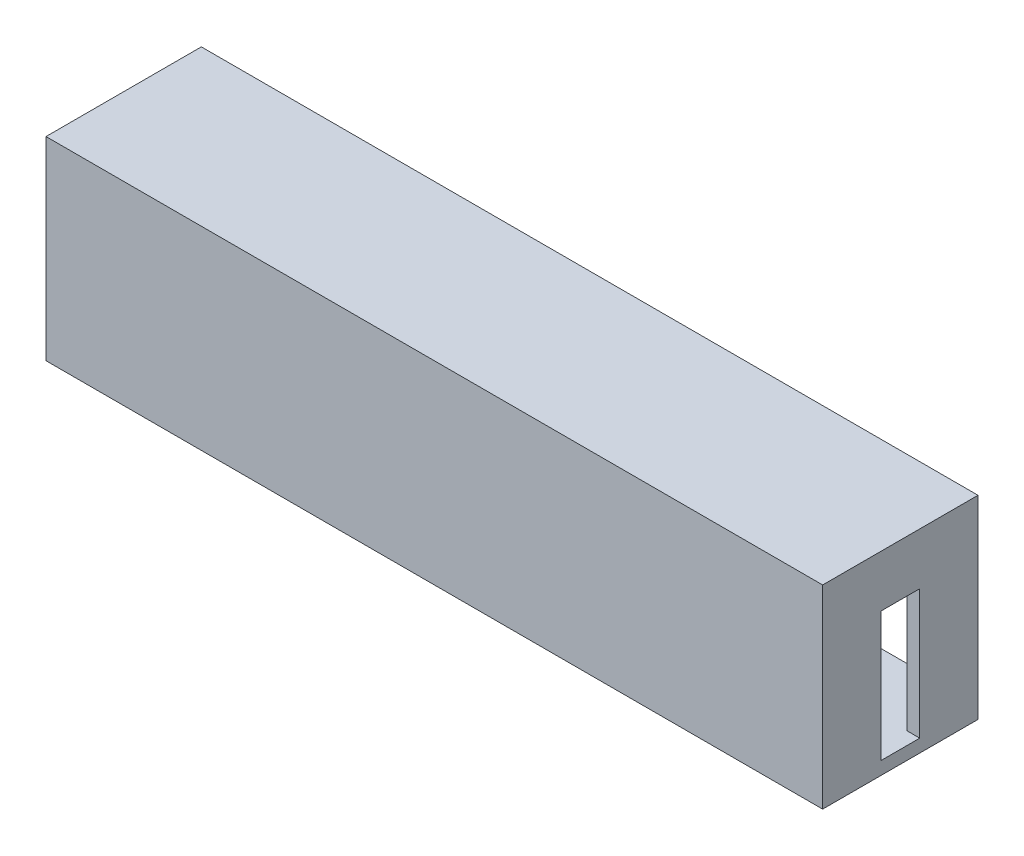
ISO-10303-21;
HEADER;
FILE_DESCRIPTION(('STEP AP214'),'2;1');
FILE_NAME('part.step','',(''),(''),'','','');
FILE_SCHEMA(('AUTOMOTIVE_DESIGN { 1 0 10303 214 1 1 1 1 }'));
ENDSEC;
DATA;
#1=APPLICATION_CONTEXT('core data for automotive mechanical design processes');
#2=APPLICATION_PROTOCOL_DEFINITION('international standard','automotive_design',2000,#1);
#3=PRODUCT_CONTEXT('',#1,'mechanical');
#4=PRODUCT('Part','Part','',(#3));
#5=PRODUCT_RELATED_PRODUCT_CATEGORY('part','',(#4));
#6=PRODUCT_DEFINITION_FORMATION('','',#4);
#7=PRODUCT_DEFINITION_CONTEXT('part definition',#1,'design');
#8=PRODUCT_DEFINITION('design','',#6,#7);
#9=PRODUCT_DEFINITION_SHAPE('','',#8);
#10=(LENGTH_UNIT() NAMED_UNIT(*) SI_UNIT(.MILLI.,.METRE.));
#11=(NAMED_UNIT(*) PLANE_ANGLE_UNIT() SI_UNIT($,.RADIAN.));
#12=(NAMED_UNIT(*) SI_UNIT($,.STERADIAN.) SOLID_ANGLE_UNIT());
#13=UNCERTAINTY_MEASURE_WITH_UNIT(LENGTH_MEASURE(1.E-05),#10,'distance_accuracy_value','');
#14=(GEOMETRIC_REPRESENTATION_CONTEXT(3) GLOBAL_UNCERTAINTY_ASSIGNED_CONTEXT((#13)) GLOBAL_UNIT_ASSIGNED_CONTEXT((#10,
#11,#12)) REPRESENTATION_CONTEXT('',''));
#15=CARTESIAN_POINT('',(0.,0.,0.));
#16=DIRECTION('',(0.,0.,1.));
#17=DIRECTION('',(1.,0.,0.));
#18=AXIS2_PLACEMENT_3D('',#15,#16,#17);
#19=CARTESIAN_POINT('',(200.,-200.,2400.));
#20=DIRECTION('',(1.,0.,0.));
#21=DIRECTION('',(0.,1.,0.));
#22=AXIS2_PLACEMENT_3D('',#19,#20,#21);
#23=PLANE('',#22);
#24=DIRECTION('',(0.,-1.,0.));
#25=VECTOR('',#24,1.);
#26=CARTESIAN_POINT('',(200.,-200.,1500.));
#27=LINE('',#26,#25);
#28=CARTESIAN_POINT('',(200.,-2180.,1500.));
#29=VERTEX_POINT('',#28);
#30=CARTESIAN_POINT('',(200.,-2800.,1500.));
#31=VERTEX_POINT('',#30);
#32=EDGE_CURVE('E302',#29,#31,#27,.T.);
#33=ORIENTED_EDGE('',*,*,#32,.F.);
#34=DIRECTION('',(0.,0.,1.));
#35=VECTOR('',#34,1.);
#36=CARTESIAN_POINT('',(200.,-2180.,1500.));
#37=LINE('',#36,#35);
#38=CARTESIAN_POINT('',(200.,-2180.,2200.));
#39=VERTEX_POINT('',#38);
#40=EDGE_CURVE('E469',#29,#39,#37,.T.);
#41=ORIENTED_EDGE('',*,*,#40,.T.);
#42=DIRECTION('',(0.,-1.,0.));
#43=VECTOR('',#42,1.);
#44=CARTESIAN_POINT('',(200.,-200.,2200.));
#45=LINE('',#44,#43);
#46=CARTESIAN_POINT('',(200.,-2800.,2200.));
#47=VERTEX_POINT('',#46);
#48=EDGE_CURVE('E486',#39,#47,#45,.T.);
#49=ORIENTED_EDGE('',*,*,#48,.T.);
#50=DIRECTION('',(0.,0.,-1.));
#51=VECTOR('',#50,1.);
#52=CARTESIAN_POINT('',(200.,-2800.,2400.));
#53=LINE('',#52,#51);
#54=EDGE_CURVE('E519',#47,#31,#53,.T.);
#55=ORIENTED_EDGE('',*,*,#54,.T.);
#56=EDGE_LOOP('',(#33,#41,#49,#55));
#57=FACE_BOUND('',#56,.T.);
#58=ADVANCED_FACE('F40',(#57),#23,.T.);
#59=CARTESIAN_POINT('',(11800.,-200.,2400.));
#60=DIRECTION('',(-1.,0.,0.));
#61=DIRECTION('',(0.,0.,1.));
#62=AXIS2_PLACEMENT_3D('',#59,#60,#61);
#63=PLANE('',#62);
#64=DIRECTION('',(0.,1.,0.));
#65=VECTOR('',#64,1.);
#66=CARTESIAN_POINT('',(11800.,-200.,1500.));
#67=LINE('',#66,#65);
#68=CARTESIAN_POINT('',(11800.,-2800.,1500.));
#69=VERTEX_POINT('',#68);
#70=CARTESIAN_POINT('',(11800.,-2180.,1500.));
#71=VERTEX_POINT('',#70);
#72=EDGE_CURVE('E297',#69,#71,#67,.T.);
#73=ORIENTED_EDGE('',*,*,#72,.F.);
#74=DIRECTION('',(0.,0.,-1.));
#75=VECTOR('',#74,1.);
#76=CARTESIAN_POINT('',(11800.,-2800.,2400.));
#77=LINE('',#76,#75);
#78=CARTESIAN_POINT('',(11800.,-2800.,2200.));
#79=VERTEX_POINT('',#78);
#80=EDGE_CURVE('E515',#79,#69,#77,.T.);
#81=ORIENTED_EDGE('',*,*,#80,.F.);
#82=DIRECTION('',(0.,1.,0.));
#83=VECTOR('',#82,1.);
#84=CARTESIAN_POINT('',(11800.,-200.,2200.));
#85=LINE('',#84,#83);
#86=CARTESIAN_POINT('',(11800.,-2180.,2200.));
#87=VERTEX_POINT('',#86);
#88=EDGE_CURVE('E477',#79,#87,#85,.T.);
#89=ORIENTED_EDGE('',*,*,#88,.T.);
#90=DIRECTION('',(0.,0.,1.));
#91=VECTOR('',#90,1.);
#92=CARTESIAN_POINT('',(11800.,-2180.,1500.));
#93=LINE('',#92,#91);
#94=EDGE_CURVE('E472',#71,#87,#93,.T.);
#95=ORIENTED_EDGE('',*,*,#94,.F.);
#96=EDGE_LOOP('',(#73,#81,#89,#95));
#97=FACE_BOUND('',#96,.T.);
#98=ADVANCED_FACE('F588',(#97),#63,.T.);
#99=CARTESIAN_POINT('',(200.,-400.000000000001,1200.));
#100=DIRECTION('',(1.,0.,0.));
#101=DIRECTION('',(0.,1.,0.));
#102=AXIS2_PLACEMENT_3D('',#99,#100,#101);
#103=CIRCLE('',#102,140.);
#104=CARTESIAN_POINT('',(200.,-260.000000000001,1200.));
#105=VERTEX_POINT('',#104);
#106=EDGE_CURVE('E573',#105,#105,#103,.T.);
#107=ORIENTED_EDGE('',*,*,#106,.F.);
#108=EDGE_LOOP('',(#107));
#109=FACE_BOUND('',#108,.T.);
#110=CARTESIAN_POINT('',(200.,-800.,1500.));
#111=VERTEX_POINT('',#110);
#112=CARTESIAN_POINT('',(200.000000000001,-2120.,1500.));
#113=VERTEX_POINT('',#112);
#114=EDGE_CURVE('E298',#111,#113,#27,.T.);
#115=ORIENTED_EDGE('',*,*,#114,.F.);
#116=DIRECTION('',(0.,0.,1.));
#117=VECTOR('',#116,1.);
#118=CARTESIAN_POINT('',(200.,-800.,2400.));
#119=LINE('',#118,#117);
#120=CARTESIAN_POINT('',(200.,-800.,900.));
#121=VERTEX_POINT('',#120);
#122=EDGE_CURVE('E325',#121,#111,#119,.T.);
#123=ORIENTED_EDGE('',*,*,#122,.F.);
#124=DIRECTION('',(0.,1.,0.));
#125=VECTOR('',#124,1.);
#126=CARTESIAN_POINT('',(200.,-200.,900.));
#127=LINE('',#126,#125);
#128=CARTESIAN_POINT('',(200.,-2800.,900.));
#129=VERTEX_POINT('',#128);
#130=EDGE_CURVE('E315',#129,#121,#127,.T.);
#131=ORIENTED_EDGE('',*,*,#130,.F.);
#132=CARTESIAN_POINT('',(200.,-2800.,0.));
#133=VERTEX_POINT('',#132);
#134=EDGE_CURVE('E518',#129,#133,#53,.T.);
#135=ORIENTED_EDGE('',*,*,#134,.T.);
#136=DIRECTION('',(0.,-1.,0.));
#137=VECTOR('',#136,1.);
#138=CARTESIAN_POINT('',(200.,-200.,0.));
#139=LINE('',#138,#137);
#140=CARTESIAN_POINT('',(200.,-200.,0.));
#141=VERTEX_POINT('',#140);
#142=EDGE_CURVE('E491',#141,#133,#139,.T.);
#143=ORIENTED_EDGE('',*,*,#142,.F.);
#144=DIRECTION('',(0.,0.,-1.));
#145=VECTOR('',#144,1.);
#146=CARTESIAN_POINT('',(200.,-200.,2400.));
#147=LINE('',#146,#145);
#148=CARTESIAN_POINT('',(200.,-200.,2200.));
#149=VERTEX_POINT('',#148);
#150=EDGE_CURVE('E508',#149,#141,#147,.T.);
#151=ORIENTED_EDGE('',*,*,#150,.F.);
#152=CARTESIAN_POINT('',(200.,-800.,2200.));
#153=VERTEX_POINT('',#152);
#154=EDGE_CURVE('E487',#149,#153,#45,.T.);
#155=ORIENTED_EDGE('',*,*,#154,.T.);
#156=DIRECTION('',(0.,0.,1.));
#157=VECTOR('',#156,1.);
#158=CARTESIAN_POINT('',(200.,-800.,1800.));
#159=LINE('',#158,#157);
#160=CARTESIAN_POINT('',(200.,-800.,1800.));
#161=VERTEX_POINT('',#160);
#162=EDGE_CURVE('E356',#161,#153,#159,.T.);
#163=ORIENTED_EDGE('',*,*,#162,.F.);
#164=DIRECTION('',(0.,1.,0.));
#165=VECTOR('',#164,1.);
#166=CARTESIAN_POINT('',(200.,-800.,1800.));
#167=LINE('',#166,#165);
#168=CARTESIAN_POINT('',(200.,-840.,1800.));
#169=VERTEX_POINT('',#168);
#170=EDGE_CURVE('E338',#169,#161,#167,.T.);
#171=ORIENTED_EDGE('',*,*,#170,.F.);
#172=DIRECTION('',(0.,0.,1.));
#173=VECTOR('',#172,1.);
#174=CARTESIAN_POINT('',(200.,-840.,1800.));
#175=LINE('',#174,#173);
#176=CARTESIAN_POINT('',(200.,-840.,2200.));
#177=VERTEX_POINT('',#176);
#178=EDGE_CURVE('E360',#169,#177,#175,.T.);
#179=ORIENTED_EDGE('',*,*,#178,.T.);
#180=CARTESIAN_POINT('',(200.,-1200.,2200.));
#181=VERTEX_POINT('',#180);
#182=EDGE_CURVE('E492',#177,#181,#45,.T.);
#183=ORIENTED_EDGE('',*,*,#182,.T.);
#184=DIRECTION('',(0.,0.,1.));
#185=VECTOR('',#184,1.);
#186=CARTESIAN_POINT('',(200.,-1200.,1800.));
#187=LINE('',#186,#185);
#188=CARTESIAN_POINT('',(200.,-1200.,1800.));
#189=VERTEX_POINT('',#188);
#190=EDGE_CURVE('E395',#189,#181,#187,.T.);
#191=ORIENTED_EDGE('',*,*,#190,.F.);
#192=DIRECTION('',(0.,1.,0.));
#193=VECTOR('',#192,1.);
#194=CARTESIAN_POINT('',(200.,-1200.,1800.));
#195=LINE('',#194,#193);
#196=CARTESIAN_POINT('',(200.,-1240.,1800.));
#197=VERTEX_POINT('',#196);
#198=EDGE_CURVE('E377',#197,#189,#195,.T.);
#199=ORIENTED_EDGE('',*,*,#198,.F.);
#200=DIRECTION('',(0.,0.,1.));
#201=VECTOR('',#200,1.);
#202=CARTESIAN_POINT('',(200.,-1240.,1800.));
#203=LINE('',#202,#201);
#204=CARTESIAN_POINT('',(200.,-1240.,2200.));
#205=VERTEX_POINT('',#204);
#206=EDGE_CURVE('E399',#197,#205,#203,.T.);
#207=ORIENTED_EDGE('',*,*,#206,.T.);
#208=CARTESIAN_POINT('',(200.,-1600.,2200.));
#209=VERTEX_POINT('',#208);
#210=EDGE_CURVE('E617',#205,#209,#45,.T.);
#211=ORIENTED_EDGE('',*,*,#210,.T.);
#212=DIRECTION('',(0.,0.,1.));
#213=VECTOR('',#212,1.);
#214=CARTESIAN_POINT('',(200.,-1600.,1800.));
#215=LINE('',#214,#213);
#216=CARTESIAN_POINT('',(200.,-1600.,1800.));
#217=VERTEX_POINT('',#216);
#218=EDGE_CURVE('E434',#217,#209,#215,.T.);
#219=ORIENTED_EDGE('',*,*,#218,.F.);
#220=DIRECTION('',(0.,1.,0.));
#221=VECTOR('',#220,1.);
#222=CARTESIAN_POINT('',(200.,-1600.,1800.));
#223=LINE('',#222,#221);
#224=CARTESIAN_POINT('',(200.,-1640.,1800.));
#225=VERTEX_POINT('',#224);
#226=EDGE_CURVE('E416',#225,#217,#223,.T.);
#227=ORIENTED_EDGE('',*,*,#226,.F.);
#228=DIRECTION('',(0.,0.,1.));
#229=VECTOR('',#228,1.);
#230=CARTESIAN_POINT('',(200.,-1640.,1800.));
#231=LINE('',#230,#229);
#232=CARTESIAN_POINT('',(200.,-1640.,2200.));
#233=VERTEX_POINT('',#232);
#234=EDGE_CURVE('E438',#225,#233,#231,.T.);
#235=ORIENTED_EDGE('',*,*,#234,.T.);
#236=CARTESIAN_POINT('',(200.,-2120.,2200.));
#237=VERTEX_POINT('',#236);
#238=EDGE_CURVE('E619',#233,#237,#45,.T.);
#239=ORIENTED_EDGE('',*,*,#238,.T.);
#240=DIRECTION('',(0.,0.,1.));
#241=VECTOR('',#240,1.);
#242=CARTESIAN_POINT('',(200.,-2120.,1500.));
#243=LINE('',#242,#241);
#244=EDGE_CURVE('E465',#113,#237,#243,.T.);
#245=ORIENTED_EDGE('',*,*,#244,.F.);
#246=EDGE_LOOP('',(#115,#123,#131,#135,#143,#151,#155,#163,#171,#179,#183,#191,#199,#207,#211,
#219,#227,#235,#239,#245));
#247=FACE_BOUND('',#246,.T.);
#248=ADVANCED_FACE('F584',(#109,#247),#23,.T.);
#249=CARTESIAN_POINT('',(11800.,-400.,1200.));
#250=DIRECTION('',(-1.,0.,0.));
#251=DIRECTION('',(0.,0.,1.));
#252=AXIS2_PLACEMENT_3D('',#249,#250,#251);
#253=CIRCLE('',#252,140.);
#254=CARTESIAN_POINT('',(11800.,-400.,1340.));
#255=VERTEX_POINT('',#254);
#256=EDGE_CURVE('E570',#255,#255,#253,.F.);
#257=ORIENTED_EDGE('',*,*,#256,.T.);
#258=EDGE_LOOP('',(#257));
#259=FACE_BOUND('',#258,.T.);
#260=CARTESIAN_POINT('',(11800.,-2120.,1500.));
#261=VERTEX_POINT('',#260);
#262=CARTESIAN_POINT('',(11800.,-800.,1500.));
#263=VERTEX_POINT('',#262);
#264=EDGE_CURVE('E293',#261,#263,#67,.T.);
#265=ORIENTED_EDGE('',*,*,#264,.F.);
#266=DIRECTION('',(0.,0.,1.));
#267=VECTOR('',#266,1.);
#268=CARTESIAN_POINT('',(11800.,-2120.,1500.));
#269=LINE('',#268,#267);
#270=CARTESIAN_POINT('',(11800.,-2120.,2200.));
#271=VERTEX_POINT('',#270);
#272=EDGE_CURVE('E455',#261,#271,#269,.T.);
#273=ORIENTED_EDGE('',*,*,#272,.T.);
#274=CARTESIAN_POINT('',(11800.,-1640.,2200.));
#275=VERTEX_POINT('',#274);
#276=EDGE_CURVE('E482',#271,#275,#85,.T.);
#277=ORIENTED_EDGE('',*,*,#276,.T.);
#278=DIRECTION('',(0.,0.,1.));
#279=VECTOR('',#278,1.);
#280=CARTESIAN_POINT('',(11800.,-1640.,1800.));
#281=LINE('',#280,#279);
#282=CARTESIAN_POINT('',(11800.,-1640.,1800.));
#283=VERTEX_POINT('',#282);
#284=EDGE_CURVE('E441',#283,#275,#281,.T.);
#285=ORIENTED_EDGE('',*,*,#284,.F.);
#286=DIRECTION('',(0.,-1.,0.));
#287=VECTOR('',#286,1.);
#288=CARTESIAN_POINT('',(11800.,-1600.,1800.));
#289=LINE('',#288,#287);
#290=CARTESIAN_POINT('',(11800.,-1600.,1800.));
#291=VERTEX_POINT('',#290);
#292=EDGE_CURVE('E407',#291,#283,#289,.T.);
#293=ORIENTED_EDGE('',*,*,#292,.F.);
#294=DIRECTION('',(0.,0.,1.));
#295=VECTOR('',#294,1.);
#296=CARTESIAN_POINT('',(11800.,-1600.,1800.));
#297=LINE('',#296,#295);
#298=CARTESIAN_POINT('',(11800.,-1600.,2200.));
#299=VERTEX_POINT('',#298);
#300=EDGE_CURVE('E424',#291,#299,#297,.T.);
#301=ORIENTED_EDGE('',*,*,#300,.T.);
#302=CARTESIAN_POINT('',(11800.,-1240.,2200.));
#303=VERTEX_POINT('',#302);
#304=EDGE_CURVE('E624',#299,#303,#85,.T.);
#305=ORIENTED_EDGE('',*,*,#304,.T.);
#306=DIRECTION('',(0.,0.,1.));
#307=VECTOR('',#306,1.);
#308=CARTESIAN_POINT('',(11800.,-1240.,1800.));
#309=LINE('',#308,#307);
#310=CARTESIAN_POINT('',(11800.,-1240.,1800.));
#311=VERTEX_POINT('',#310);
#312=EDGE_CURVE('E402',#311,#303,#309,.T.);
#313=ORIENTED_EDGE('',*,*,#312,.F.);
#314=DIRECTION('',(0.,-1.,0.));
#315=VECTOR('',#314,1.);
#316=CARTESIAN_POINT('',(11800.,-1200.,1800.));
#317=LINE('',#316,#315);
#318=CARTESIAN_POINT('',(11800.,-1200.,1800.));
#319=VERTEX_POINT('',#318);
#320=EDGE_CURVE('E368',#319,#311,#317,.T.);
#321=ORIENTED_EDGE('',*,*,#320,.F.);
#322=DIRECTION('',(0.,0.,1.));
#323=VECTOR('',#322,1.);
#324=CARTESIAN_POINT('',(11800.,-1200.,1800.));
#325=LINE('',#324,#323);
#326=CARTESIAN_POINT('',(11800.,-1200.,2200.));
#327=VERTEX_POINT('',#326);
#328=EDGE_CURVE('E385',#319,#327,#325,.T.);
#329=ORIENTED_EDGE('',*,*,#328,.T.);
#330=CARTESIAN_POINT('',(11800.,-840.,2200.));
#331=VERTEX_POINT('',#330);
#332=EDGE_CURVE('E627',#327,#331,#85,.T.);
#333=ORIENTED_EDGE('',*,*,#332,.T.);
#334=DIRECTION('',(0.,0.,1.));
#335=VECTOR('',#334,1.);
#336=CARTESIAN_POINT('',(11800.,-840.,1800.));
#337=LINE('',#336,#335);
#338=CARTESIAN_POINT('',(11800.,-840.,1800.));
#339=VERTEX_POINT('',#338);
#340=EDGE_CURVE('E363',#339,#331,#337,.T.);
#341=ORIENTED_EDGE('',*,*,#340,.F.);
#342=DIRECTION('',(0.,-1.,0.));
#343=VECTOR('',#342,1.);
#344=CARTESIAN_POINT('',(11800.,-800.,1800.));
#345=LINE('',#344,#343);
#346=CARTESIAN_POINT('',(11800.,-800.,1800.));
#347=VERTEX_POINT('',#346);
#348=EDGE_CURVE('E329',#347,#339,#345,.T.);
#349=ORIENTED_EDGE('',*,*,#348,.F.);
#350=DIRECTION('',(0.,0.,1.));
#351=VECTOR('',#350,1.);
#352=CARTESIAN_POINT('',(11800.,-800.,1800.));
#353=LINE('',#352,#351);
#354=CARTESIAN_POINT('',(11800.,-800.,2200.));
#355=VERTEX_POINT('',#354);
#356=EDGE_CURVE('E346',#347,#355,#353,.T.);
#357=ORIENTED_EDGE('',*,*,#356,.T.);
#358=CARTESIAN_POINT('',(11800.,-200.,2200.));
#359=VERTEX_POINT('',#358);
#360=EDGE_CURVE('E476',#355,#359,#85,.T.);
#361=ORIENTED_EDGE('',*,*,#360,.T.);
#362=DIRECTION('',(0.,0.,-1.));
#363=VECTOR('',#362,1.);
#364=CARTESIAN_POINT('',(11800.,-200.,2400.));
#365=LINE('',#364,#363);
#366=CARTESIAN_POINT('',(11800.,-200.,0.));
#367=VERTEX_POINT('',#366);
#368=EDGE_CURVE('E511',#359,#367,#365,.T.);
#369=ORIENTED_EDGE('',*,*,#368,.T.);
#370=DIRECTION('',(0.,1.,0.));
#371=VECTOR('',#370,1.);
#372=CARTESIAN_POINT('',(11800.,-200.,0.));
#373=LINE('',#372,#371);
#374=CARTESIAN_POINT('',(11800.,-2800.,0.));
#375=VERTEX_POINT('',#374);
#376=EDGE_CURVE('E500',#375,#367,#373,.T.);
#377=ORIENTED_EDGE('',*,*,#376,.F.);
#378=CARTESIAN_POINT('',(11800.,-2800.,900.));
#379=VERTEX_POINT('',#378);
#380=EDGE_CURVE('E514',#379,#375,#77,.T.);
#381=ORIENTED_EDGE('',*,*,#380,.F.);
#382=DIRECTION('',(0.,-1.,0.));
#383=VECTOR('',#382,1.);
#384=CARTESIAN_POINT('',(11800.,-200.,900.));
#385=LINE('',#384,#383);
#386=CARTESIAN_POINT('',(11800.,-800.,900.));
#387=VERTEX_POINT('',#386);
#388=EDGE_CURVE('E256',#387,#379,#385,.T.);
#389=ORIENTED_EDGE('',*,*,#388,.F.);
#390=DIRECTION('',(0.,0.,-1.));
#391=VECTOR('',#390,1.);
#392=CARTESIAN_POINT('',(11800.,-800.,2400.));
#393=LINE('',#392,#391);
#394=EDGE_CURVE('E322',#263,#387,#393,.T.);
#395=ORIENTED_EDGE('',*,*,#394,.F.);
#396=EDGE_LOOP('',(#265,#273,#277,#285,#293,#301,#305,#313,#321,#329,#333,#341,#349,#357,#361,
#369,#377,#381,#389,#395));
#397=FACE_BOUND('',#396,.T.);
#398=ADVANCED_FACE('F587',(#259,#397),#63,.T.);
#399=CARTESIAN_POINT('',(0.,0.,2200.));
#400=DIRECTION('',(0.,0.,1.));
#401=DIRECTION('',(1.,0.,0.));
#402=AXIS2_PLACEMENT_3D('',#399,#400,#401);
#403=PLANE('',#402);
#404=DIRECTION('',(-1.,0.,0.));
#405=VECTOR('',#404,1.);
#406=CARTESIAN_POINT('',(11800.,-840.,2200.));
#407=LINE('',#406,#405);
#408=EDGE_CURVE('E328',#331,#177,#407,.T.);
#409=ORIENTED_EDGE('',*,*,#408,.F.);
#410=ORIENTED_EDGE('',*,*,#332,.F.);
#411=DIRECTION('',(1.,0.,0.));
#412=VECTOR('',#411,1.);
#413=CARTESIAN_POINT('',(11800.,-1200.,2200.));
#414=LINE('',#413,#412);
#415=EDGE_CURVE('E373',#181,#327,#414,.T.);
#416=ORIENTED_EDGE('',*,*,#415,.F.);
#417=ORIENTED_EDGE('',*,*,#182,.F.);
#418=EDGE_LOOP('',(#409,#410,#416,#417));
#419=FACE_BOUND('',#418,.T.);
#420=ADVANCED_FACE('F648',(#419),#403,.F.);
#421=DIRECTION('',(1.,0.,0.));
#422=VECTOR('',#421,1.);
#423=CARTESIAN_POINT('',(11800.,-800.,2200.));
#424=LINE('',#423,#422);
#425=EDGE_CURVE('E334',#153,#355,#424,.T.);
#426=ORIENTED_EDGE('',*,*,#425,.F.);
#427=ORIENTED_EDGE('',*,*,#154,.F.);
#428=DIRECTION('',(-1.,0.,0.));
#429=VECTOR('',#428,1.);
#430=CARTESIAN_POINT('',(200.,-200.,2200.));
#431=LINE('',#430,#429);
#432=EDGE_CURVE('E564',#359,#149,#431,.T.);
#433=ORIENTED_EDGE('',*,*,#432,.F.);
#434=ORIENTED_EDGE('',*,*,#360,.F.);
#435=EDGE_LOOP('',(#426,#427,#433,#434));
#436=FACE_BOUND('',#435,.T.);
#437=ADVANCED_FACE('F660',(#436),#403,.F.);
#438=DIRECTION('',(-1.,0.,0.));
#439=VECTOR('',#438,1.);
#440=CARTESIAN_POINT('',(11800.,-1240.,2200.));
#441=LINE('',#440,#439);
#442=EDGE_CURVE('E367',#303,#205,#441,.T.);
#443=ORIENTED_EDGE('',*,*,#442,.F.);
#444=ORIENTED_EDGE('',*,*,#304,.F.);
#445=DIRECTION('',(1.,0.,0.));
#446=VECTOR('',#445,1.);
#447=CARTESIAN_POINT('',(11800.,-1600.,2200.));
#448=LINE('',#447,#446);
#449=EDGE_CURVE('E412',#209,#299,#448,.T.);
#450=ORIENTED_EDGE('',*,*,#449,.F.);
#451=ORIENTED_EDGE('',*,*,#210,.F.);
#452=EDGE_LOOP('',(#443,#444,#450,#451));
#453=FACE_BOUND('',#452,.T.);
#454=ADVANCED_FACE('F655',(#453),#403,.F.);
#455=DIRECTION('',(-1.,0.,0.));
#456=VECTOR('',#455,1.);
#457=CARTESIAN_POINT('',(11800.,-1640.,2200.));
#458=LINE('',#457,#456);
#459=EDGE_CURVE('E406',#275,#233,#458,.T.);
#460=ORIENTED_EDGE('',*,*,#459,.F.);
#461=ORIENTED_EDGE('',*,*,#276,.F.);
#462=DIRECTION('',(1.,0.,0.));
#463=VECTOR('',#462,1.);
#464=CARTESIAN_POINT('',(11800.,-2120.,2200.));
#465=LINE('',#464,#463);
#466=EDGE_CURVE('E451',#237,#271,#465,.T.);
#467=ORIENTED_EDGE('',*,*,#466,.F.);
#468=ORIENTED_EDGE('',*,*,#238,.F.);
#469=EDGE_LOOP('',(#460,#461,#467,#468));
#470=FACE_BOUND('',#469,.T.);
#471=ADVANCED_FACE('F646',(#470),#403,.F.);
#472=DIRECTION('',(-1.,0.,0.));
#473=VECTOR('',#472,1.);
#474=CARTESIAN_POINT('',(11800.,-2180.,2200.));
#475=LINE('',#474,#473);
#476=EDGE_CURVE('E445',#87,#39,#475,.T.);
#477=ORIENTED_EDGE('',*,*,#476,.F.);
#478=ORIENTED_EDGE('',*,*,#88,.F.);
#479=DIRECTION('',(1.,0.,0.));
#480=VECTOR('',#479,1.);
#481=CARTESIAN_POINT('',(200.,-2800.,2200.));
#482=LINE('',#481,#480);
#483=EDGE_CURVE('E481',#47,#79,#482,.T.);
#484=ORIENTED_EDGE('',*,*,#483,.F.);
#485=ORIENTED_EDGE('',*,*,#48,.F.);
#486=EDGE_LOOP('',(#477,#478,#484,#485));
#487=FACE_BOUND('',#486,.T.);
#488=ADVANCED_FACE('F644',(#487),#403,.F.);
#489=CARTESIAN_POINT('',(200.,-2800.,2400.));
#490=DIRECTION('',(0.,1.,0.));
#491=DIRECTION('',(0.,0.,1.));
#492=AXIS2_PLACEMENT_3D('',#489,#490,#491);
#493=PLANE('',#492);
#494=ORIENTED_EDGE('',*,*,#134,.F.);
#495=DIRECTION('',(1.,0.,0.));
#496=VECTOR('',#495,1.);
#497=CARTESIAN_POINT('',(-2169.,-2800.,900.));
#498=LINE('',#497,#496);
#499=CARTESIAN_POINT('',(0.,-2800.,900.));
#500=VERTEX_POINT('',#499);
#501=EDGE_CURVE('E259',#500,#129,#498,.T.);
#502=ORIENTED_EDGE('',*,*,#501,.F.);
#503=DIRECTION('',(0.,0.,-1.));
#504=VECTOR('',#503,1.);
#505=CARTESIAN_POINT('',(0.,-2800.,2400.));
#506=LINE('',#505,#504);
#507=CARTESIAN_POINT('',(0.,-2800.,1500.));
#508=VERTEX_POINT('',#507);
#509=EDGE_CURVE('E301',#508,#500,#506,.T.);
#510=ORIENTED_EDGE('',*,*,#509,.F.);
#511=DIRECTION('',(1.,0.,0.));
#512=VECTOR('',#511,1.);
#513=CARTESIAN_POINT('',(-2169.,-2800.,1500.));
#514=LINE('',#513,#512);
#515=EDGE_CURVE('E64',#508,#31,#514,.T.);
#516=ORIENTED_EDGE('',*,*,#515,.T.);
#517=ORIENTED_EDGE('',*,*,#54,.F.);
#518=ORIENTED_EDGE('',*,*,#483,.T.);
#519=ORIENTED_EDGE('',*,*,#80,.T.);
#520=CARTESIAN_POINT('',(12000.,-2800.,1500.));
#521=VERTEX_POINT('',#520);
#522=EDGE_CURVE('E267',#69,#521,#514,.T.);
#523=ORIENTED_EDGE('',*,*,#522,.T.);
#524=DIRECTION('',(0.,0.,-1.));
#525=VECTOR('',#524,1.);
#526=CARTESIAN_POINT('',(12000.,-2800.,1500.));
#527=LINE('',#526,#525);
#528=CARTESIAN_POINT('',(12000.,-2800.,900.));
#529=VERTEX_POINT('',#528);
#530=EDGE_CURVE('E263',#521,#529,#527,.T.);
#531=ORIENTED_EDGE('',*,*,#530,.T.);
#532=EDGE_CURVE('E57',#379,#529,#498,.T.);
#533=ORIENTED_EDGE('',*,*,#532,.F.);
#534=ORIENTED_EDGE('',*,*,#380,.T.);
#535=DIRECTION('',(1.,0.,0.));
#536=VECTOR('',#535,1.);
#537=CARTESIAN_POINT('',(200.,-2800.,0.));
#538=LINE('',#537,#536);
#539=EDGE_CURVE('E496',#133,#375,#538,.T.);
#540=ORIENTED_EDGE('',*,*,#539,.F.);
#541=EDGE_LOOP('',(#494,#502,#510,#516,#517,#518,#519,#523,#531,#533,#534,#540));
#542=FACE_BOUND('',#541,.T.);
#543=ADVANCED_FACE('F265',(#542),#493,.T.);
#544=CARTESIAN_POINT('',(200.,-200.,2400.));
#545=DIRECTION('',(0.,-1.,0.));
#546=DIRECTION('',(0.,0.,-1.));
#547=AXIS2_PLACEMENT_3D('',#544,#545,#546);
#548=PLANE('',#547);
#549=ORIENTED_EDGE('',*,*,#368,.F.);
#550=ORIENTED_EDGE('',*,*,#432,.T.);
#551=ORIENTED_EDGE('',*,*,#150,.T.);
#552=DIRECTION('',(-1.,0.,0.));
#553=VECTOR('',#552,1.);
#554=CARTESIAN_POINT('',(200.,-200.,0.));
#555=LINE('',#554,#553);
#556=EDGE_CURVE('E504',#367,#141,#555,.T.);
#557=ORIENTED_EDGE('',*,*,#556,.F.);
#558=EDGE_LOOP('',(#549,#550,#551,#557));
#559=FACE_BOUND('',#558,.T.);
#560=ADVANCED_FACE('F653',(#559),#548,.T.);
#561=CARTESIAN_POINT('',(0.,0.,2400.));
#562=DIRECTION('',(0.,0.,1.));
#563=DIRECTION('',(1.,0.,0.));
#564=AXIS2_PLACEMENT_3D('',#561,#562,#563);
#565=PLANE('',#564);
#566=DIRECTION('',(0.,-1.,0.));
#567=VECTOR('',#566,1.);
#568=CARTESIAN_POINT('',(0.,0.,2400.));
#569=LINE('',#568,#567);
#570=CARTESIAN_POINT('',(0.,0.,2400.));
#571=VERTEX_POINT('',#570);
#572=CARTESIAN_POINT('',(0.,-3000.,2400.));
#573=VERTEX_POINT('',#572);
#574=EDGE_CURVE('E524',#571,#573,#569,.T.);
#575=ORIENTED_EDGE('',*,*,#574,.T.);
#576=DIRECTION('',(1.,0.,0.));
#577=VECTOR('',#576,1.);
#578=CARTESIAN_POINT('',(0.,-3000.,2400.));
#579=LINE('',#578,#577);
#580=CARTESIAN_POINT('',(12000.,-3000.,2400.));
#581=VERTEX_POINT('',#580);
#582=EDGE_CURVE('E528',#573,#581,#579,.T.);
#583=ORIENTED_EDGE('',*,*,#582,.T.);
#584=DIRECTION('',(0.,1.,0.));
#585=VECTOR('',#584,1.);
#586=CARTESIAN_POINT('',(12000.,0.,2400.));
#587=LINE('',#586,#585);
#588=CARTESIAN_POINT('',(12000.,0.,2400.));
#589=VERTEX_POINT('',#588);
#590=EDGE_CURVE('E532',#581,#589,#587,.T.);
#591=ORIENTED_EDGE('',*,*,#590,.T.);
#592=DIRECTION('',(-1.,0.,0.));
#593=VECTOR('',#592,1.);
#594=CARTESIAN_POINT('',(0.,0.,2400.));
#595=LINE('',#594,#593);
#596=EDGE_CURVE('E535',#589,#571,#595,.T.);
#597=ORIENTED_EDGE('',*,*,#596,.T.);
#598=EDGE_LOOP('',(#575,#583,#591,#597));
#599=FACE_BOUND('',#598,.T.);
#600=ADVANCED_FACE('F770',(#599),#565,.T.);
#601=CARTESIAN_POINT('',(0.,0.,0.));
#602=DIRECTION('',(0.,0.,1.));
#603=DIRECTION('',(1.,0.,0.));
#604=AXIS2_PLACEMENT_3D('',#601,#602,#603);
#605=PLANE('',#604);
#606=DIRECTION('',(0.,-1.,0.));
#607=VECTOR('',#606,1.);
#608=CARTESIAN_POINT('',(0.,0.,0.));
#609=LINE('',#608,#607);
#610=CARTESIAN_POINT('',(0.,0.,0.));
#611=VERTEX_POINT('',#610);
#612=CARTESIAN_POINT('',(0.,-3000.,0.));
#613=VERTEX_POINT('',#612);
#614=EDGE_CURVE('E523',#611,#613,#609,.T.);
#615=ORIENTED_EDGE('',*,*,#614,.F.);
#616=DIRECTION('',(-1.,0.,0.));
#617=VECTOR('',#616,1.);
#618=CARTESIAN_POINT('',(0.,0.,0.));
#619=LINE('',#618,#617);
#620=CARTESIAN_POINT('',(12000.,0.,0.));
#621=VERTEX_POINT('',#620);
#622=EDGE_CURVE('E529',#621,#611,#619,.T.);
#623=ORIENTED_EDGE('',*,*,#622,.F.);
#624=DIRECTION('',(0.,1.,0.));
#625=VECTOR('',#624,1.);
#626=CARTESIAN_POINT('',(12000.,0.,0.));
#627=LINE('',#626,#625);
#628=CARTESIAN_POINT('',(12000.,-3000.,0.));
#629=VERTEX_POINT('',#628);
#630=EDGE_CURVE('E546',#629,#621,#627,.T.);
#631=ORIENTED_EDGE('',*,*,#630,.F.);
#632=DIRECTION('',(1.,0.,0.));
#633=VECTOR('',#632,1.);
#634=CARTESIAN_POINT('',(0.,-3000.,0.));
#635=LINE('',#634,#633);
#636=EDGE_CURVE('E542',#613,#629,#635,.T.);
#637=ORIENTED_EDGE('',*,*,#636,.F.);
#638=EDGE_LOOP('',(#615,#623,#631,#637));
#639=FACE_BOUND('',#638,.T.);
#640=ORIENTED_EDGE('',*,*,#142,.T.);
#641=ORIENTED_EDGE('',*,*,#539,.T.);
#642=ORIENTED_EDGE('',*,*,#376,.T.);
#643=ORIENTED_EDGE('',*,*,#556,.T.);
#644=EDGE_LOOP('',(#640,#641,#642,#643));
#645=FACE_BOUND('',#644,.T.);
#646=ADVANCED_FACE('F748',(#639,#645),#605,.F.);
#647=CARTESIAN_POINT('',(0.,0.,2400.));
#648=DIRECTION('',(1.,0.,0.));
#649=DIRECTION('',(0.,0.,-1.));
#650=AXIS2_PLACEMENT_3D('',#647,#648,#649);
#651=PLANE('',#650);
#652=DIRECTION('',(0.,0.,1.));
#653=VECTOR('',#652,1.);
#654=CARTESIAN_POINT('',(0.,-800.,2400.));
#655=LINE('',#654,#653);
#656=CARTESIAN_POINT('',(0.,-800.,900.));
#657=VERTEX_POINT('',#656);
#658=CARTESIAN_POINT('',(0.,-800.,1500.));
#659=VERTEX_POINT('',#658);
#660=EDGE_CURVE('E318',#657,#659,#655,.T.);
#661=ORIENTED_EDGE('',*,*,#660,.T.);
#662=DIRECTION('',(0.,-1.,0.));
#663=VECTOR('',#662,1.);
#664=CARTESIAN_POINT('',(0.,0.,1500.));
#665=LINE('',#664,#663);
#666=EDGE_CURVE('E296',#659,#508,#665,.T.);
#667=ORIENTED_EDGE('',*,*,#666,.T.);
#668=ORIENTED_EDGE('',*,*,#509,.T.);
#669=DIRECTION('',(0.,1.,0.));
#670=VECTOR('',#669,1.);
#671=CARTESIAN_POINT('',(0.,0.,900.));
#672=LINE('',#671,#670);
#673=EDGE_CURVE('E309',#500,#657,#672,.T.);
#674=ORIENTED_EDGE('',*,*,#673,.T.);
#675=EDGE_LOOP('',(#661,#667,#668,#674));
#676=FACE_BOUND('',#675,.T.);
#677=DIRECTION('',(0.,0.,-1.));
#678=VECTOR('',#677,1.);
#679=CARTESIAN_POINT('',(0.,0.,2400.));
#680=LINE('',#679,#678);
#681=EDGE_CURVE('E538',#571,#611,#680,.T.);
#682=ORIENTED_EDGE('',*,*,#681,.T.);
#683=ORIENTED_EDGE('',*,*,#614,.T.);
#684=DIRECTION('',(0.,0.,-1.));
#685=VECTOR('',#684,1.);
#686=CARTESIAN_POINT('',(0.,-3000.,2400.));
#687=LINE('',#686,#685);
#688=EDGE_CURVE('E561',#573,#613,#687,.T.);
#689=ORIENTED_EDGE('',*,*,#688,.F.);
#690=ORIENTED_EDGE('',*,*,#574,.F.);
#691=EDGE_LOOP('',(#682,#683,#689,#690));
#692=FACE_BOUND('',#691,.T.);
#693=ADVANCED_FACE('F42',(#676,#692),#651,.F.);
#694=CARTESIAN_POINT('',(0.,-3000.,2400.));
#695=DIRECTION('',(0.,1.,0.));
#696=DIRECTION('',(0.,0.,1.));
#697=AXIS2_PLACEMENT_3D('',#694,#695,#696);
#698=PLANE('',#697);
#699=ORIENTED_EDGE('',*,*,#688,.T.);
#700=ORIENTED_EDGE('',*,*,#636,.T.);
#701=DIRECTION('',(0.,0.,-1.));
#702=VECTOR('',#701,1.);
#703=CARTESIAN_POINT('',(12000.,-3000.,2400.));
#704=LINE('',#703,#702);
#705=EDGE_CURVE('E558',#581,#629,#704,.T.);
#706=ORIENTED_EDGE('',*,*,#705,.F.);
#707=ORIENTED_EDGE('',*,*,#582,.F.);
#708=EDGE_LOOP('',(#699,#700,#706,#707));
#709=FACE_BOUND('',#708,.T.);
#710=ADVANCED_FACE('F745',(#709),#698,.F.);
#711=CARTESIAN_POINT('',(12000.,0.,2400.));
#712=DIRECTION('',(-1.,0.,0.));
#713=DIRECTION('',(0.,0.,1.));
#714=AXIS2_PLACEMENT_3D('',#711,#712,#713);
#715=PLANE('',#714);
#716=ORIENTED_EDGE('',*,*,#530,.F.);
#717=DIRECTION('',(0.,-1.,0.));
#718=VECTOR('',#717,1.);
#719=CARTESIAN_POINT('',(12000.,-2800.,1500.));
#720=LINE('',#719,#718);
#721=CARTESIAN_POINT('',(12000.,-800.,1500.));
#722=VERTEX_POINT('',#721);
#723=EDGE_CURVE('E271',#722,#521,#720,.T.);
#724=ORIENTED_EDGE('',*,*,#723,.F.);
#725=DIRECTION('',(0.,0.,1.));
#726=VECTOR('',#725,1.);
#727=CARTESIAN_POINT('',(12000.,-800.,1500.));
#728=LINE('',#727,#726);
#729=CARTESIAN_POINT('',(12000.,-800.,900.));
#730=VERTEX_POINT('',#729);
#731=EDGE_CURVE('E276',#730,#722,#728,.T.);
#732=ORIENTED_EDGE('',*,*,#731,.F.);
#733=DIRECTION('',(0.,1.,0.));
#734=VECTOR('',#733,1.);
#735=CARTESIAN_POINT('',(12000.,-2800.,900.));
#736=LINE('',#735,#734);
#737=EDGE_CURVE('E253',#529,#730,#736,.T.);
#738=ORIENTED_EDGE('',*,*,#737,.F.);
#739=EDGE_LOOP('',(#716,#724,#732,#738));
#740=FACE_BOUND('',#739,.T.);
#741=ORIENTED_EDGE('',*,*,#705,.T.);
#742=ORIENTED_EDGE('',*,*,#630,.T.);
#743=DIRECTION('',(0.,0.,-1.));
#744=VECTOR('',#743,1.);
#745=CARTESIAN_POINT('',(12000.,0.,2400.));
#746=LINE('',#745,#744);
#747=EDGE_CURVE('E555',#589,#621,#746,.T.);
#748=ORIENTED_EDGE('',*,*,#747,.F.);
#749=ORIENTED_EDGE('',*,*,#590,.F.);
#750=EDGE_LOOP('',(#741,#742,#748,#749));
#751=FACE_BOUND('',#750,.T.);
#752=ADVANCED_FACE('F273',(#740,#751),#715,.F.);
#753=CARTESIAN_POINT('',(0.,0.,2400.));
#754=DIRECTION('',(0.,-1.,0.));
#755=DIRECTION('',(0.,0.,-1.));
#756=AXIS2_PLACEMENT_3D('',#753,#754,#755);
#757=PLANE('',#756);
#758=ORIENTED_EDGE('',*,*,#747,.T.);
#759=ORIENTED_EDGE('',*,*,#622,.T.);
#760=ORIENTED_EDGE('',*,*,#681,.F.);
#761=ORIENTED_EDGE('',*,*,#596,.F.);
#762=EDGE_LOOP('',(#758,#759,#760,#761));
#763=FACE_BOUND('',#762,.T.);
#764=ADVANCED_FACE('F736',(#763),#757,.F.);
#765=CARTESIAN_POINT('',(11800.,-2180.,1500.));
#766=DIRECTION('',(0.,1.,0.));
#767=DIRECTION('',(0.,0.,1.));
#768=AXIS2_PLACEMENT_3D('',#765,#766,#767);
#769=PLANE('',#768);
#770=ORIENTED_EDGE('',*,*,#476,.T.);
#771=ORIENTED_EDGE('',*,*,#40,.F.);
#772=DIRECTION('',(-1.,0.,0.));
#773=VECTOR('',#772,1.);
#774=CARTESIAN_POINT('',(11800.,-2180.,1500.));
#775=LINE('',#774,#773);
#776=EDGE_CURVE('E446',#71,#29,#775,.T.);
#777=ORIENTED_EDGE('',*,*,#776,.F.);
#778=ORIENTED_EDGE('',*,*,#94,.T.);
#779=EDGE_LOOP('',(#770,#771,#777,#778));
#780=FACE_BOUND('',#779,.T.);
#781=ADVANCED_FACE('F639',(#780),#769,.F.);
#782=CARTESIAN_POINT('',(11800.,-2120.,1500.));
#783=DIRECTION('',(0.,-1.,0.));
#784=DIRECTION('',(0.,0.,-1.));
#785=AXIS2_PLACEMENT_3D('',#782,#783,#784);
#786=PLANE('',#785);
#787=ORIENTED_EDGE('',*,*,#466,.T.);
#788=ORIENTED_EDGE('',*,*,#272,.F.);
#789=DIRECTION('',(1.,0.,0.));
#790=VECTOR('',#789,1.);
#791=CARTESIAN_POINT('',(11800.,-2120.,1500.));
#792=LINE('',#791,#790);
#793=EDGE_CURVE('E450',#113,#261,#792,.T.);
#794=ORIENTED_EDGE('',*,*,#793,.F.);
#795=ORIENTED_EDGE('',*,*,#244,.T.);
#796=EDGE_LOOP('',(#787,#788,#794,#795));
#797=FACE_BOUND('',#796,.T.);
#798=ADVANCED_FACE('F732',(#797),#786,.F.);
#799=CARTESIAN_POINT('',(0.,0.,1500.));
#800=DIRECTION('',(0.,0.,-1.));
#801=DIRECTION('',(-1.,0.,0.));
#802=AXIS2_PLACEMENT_3D('',#799,#800,#801);
#803=PLANE('',#802);
#804=ORIENTED_EDGE('',*,*,#793,.T.);
#805=ORIENTED_EDGE('',*,*,#264,.T.);
#806=DIRECTION('',(1.,0.,0.));
#807=VECTOR('',#806,1.);
#808=CARTESIAN_POINT('',(-2169.,-800.,1500.));
#809=LINE('',#808,#807);
#810=EDGE_CURVE('E283',#263,#722,#809,.T.);
#811=ORIENTED_EDGE('',*,*,#810,.T.);
#812=ORIENTED_EDGE('',*,*,#723,.T.);
#813=ORIENTED_EDGE('',*,*,#522,.F.);
#814=ORIENTED_EDGE('',*,*,#72,.T.);
#815=ORIENTED_EDGE('',*,*,#776,.T.);
#816=ORIENTED_EDGE('',*,*,#32,.T.);
#817=ORIENTED_EDGE('',*,*,#515,.F.);
#818=ORIENTED_EDGE('',*,*,#666,.F.);
#819=EDGE_CURVE('E286',#659,#111,#809,.T.);
#820=ORIENTED_EDGE('',*,*,#819,.T.);
#821=ORIENTED_EDGE('',*,*,#114,.T.);
#822=EDGE_LOOP('',(#804,#805,#811,#812,#813,#814,#815,#816,#817,#818,#820,#821));
#823=FACE_BOUND('',#822,.T.);
#824=ADVANCED_FACE('F598',(#823),#803,.T.);
#825=CARTESIAN_POINT('',(11800.,-1640.,1800.));
#826=DIRECTION('',(0.,1.,0.));
#827=DIRECTION('',(-1.,0.,0.));
#828=AXIS2_PLACEMENT_3D('',#825,#826,#827);
#829=PLANE('',#828);
#830=ORIENTED_EDGE('',*,*,#459,.T.);
#831=ORIENTED_EDGE('',*,*,#234,.F.);
#832=DIRECTION('',(-1.,0.,0.));
#833=VECTOR('',#832,1.);
#834=CARTESIAN_POINT('',(11800.,-1640.,1800.));
#835=LINE('',#834,#833);
#836=EDGE_CURVE('E411',#283,#225,#835,.T.);
#837=ORIENTED_EDGE('',*,*,#836,.F.);
#838=ORIENTED_EDGE('',*,*,#284,.T.);
#839=EDGE_LOOP('',(#830,#831,#837,#838));
#840=FACE_BOUND('',#839,.T.);
#841=ADVANCED_FACE('F725',(#840),#829,.F.);
#842=CARTESIAN_POINT('',(11800.,-1600.,1800.));
#843=DIRECTION('',(0.,-1.,0.));
#844=DIRECTION('',(0.,0.,-1.));
#845=AXIS2_PLACEMENT_3D('',#842,#843,#844);
#846=PLANE('',#845);
#847=ORIENTED_EDGE('',*,*,#449,.T.);
#848=ORIENTED_EDGE('',*,*,#300,.F.);
#849=DIRECTION('',(1.,0.,0.));
#850=VECTOR('',#849,1.);
#851=CARTESIAN_POINT('',(11800.,-1600.,1800.));
#852=LINE('',#851,#850);
#853=EDGE_CURVE('E420',#217,#291,#852,.T.);
#854=ORIENTED_EDGE('',*,*,#853,.F.);
#855=ORIENTED_EDGE('',*,*,#218,.T.);
#856=EDGE_LOOP('',(#847,#848,#854,#855));
#857=FACE_BOUND('',#856,.T.);
#858=ADVANCED_FACE('F721',(#857),#846,.F.);
#859=CARTESIAN_POINT('',(0.,0.,1800.));
#860=DIRECTION('',(0.,0.,-1.));
#861=DIRECTION('',(-1.,0.,0.));
#862=AXIS2_PLACEMENT_3D('',#859,#860,#861);
#863=PLANE('',#862);
#864=ORIENTED_EDGE('',*,*,#292,.T.);
#865=ORIENTED_EDGE('',*,*,#836,.T.);
#866=ORIENTED_EDGE('',*,*,#226,.T.);
#867=ORIENTED_EDGE('',*,*,#853,.T.);
#868=EDGE_LOOP('',(#864,#865,#866,#867));
#869=FACE_BOUND('',#868,.T.);
#870=ADVANCED_FACE('F717',(#869),#863,.T.);
#871=CARTESIAN_POINT('',(11800.,-1240.,1800.));
#872=DIRECTION('',(0.,1.,0.));
#873=DIRECTION('',(0.,0.,1.));
#874=AXIS2_PLACEMENT_3D('',#871,#872,#873);
#875=PLANE('',#874);
#876=ORIENTED_EDGE('',*,*,#442,.T.);
#877=ORIENTED_EDGE('',*,*,#206,.F.);
#878=DIRECTION('',(-1.,0.,0.));
#879=VECTOR('',#878,1.);
#880=CARTESIAN_POINT('',(11800.,-1240.,1800.));
#881=LINE('',#880,#879);
#882=EDGE_CURVE('E372',#311,#197,#881,.T.);
#883=ORIENTED_EDGE('',*,*,#882,.F.);
#884=ORIENTED_EDGE('',*,*,#312,.T.);
#885=EDGE_LOOP('',(#876,#877,#883,#884));
#886=FACE_BOUND('',#885,.T.);
#887=ADVANCED_FACE('F713',(#886),#875,.F.);
#888=CARTESIAN_POINT('',(11800.,-1200.,1800.));
#889=DIRECTION('',(0.,-1.,0.));
#890=DIRECTION('',(0.,0.,-1.));
#891=AXIS2_PLACEMENT_3D('',#888,#889,#890);
#892=PLANE('',#891);
#893=ORIENTED_EDGE('',*,*,#415,.T.);
#894=ORIENTED_EDGE('',*,*,#328,.F.);
#895=DIRECTION('',(1.,0.,0.));
#896=VECTOR('',#895,1.);
#897=CARTESIAN_POINT('',(11800.,-1200.,1800.));
#898=LINE('',#897,#896);
#899=EDGE_CURVE('E381',#189,#319,#898,.T.);
#900=ORIENTED_EDGE('',*,*,#899,.F.);
#901=ORIENTED_EDGE('',*,*,#190,.T.);
#902=EDGE_LOOP('',(#893,#894,#900,#901));
#903=FACE_BOUND('',#902,.T.);
#904=ADVANCED_FACE('F709',(#903),#892,.F.);
#905=CARTESIAN_POINT('',(0.,0.,1800.));
#906=DIRECTION('',(0.,0.,-1.));
#907=DIRECTION('',(-1.,0.,0.));
#908=AXIS2_PLACEMENT_3D('',#905,#906,#907);
#909=PLANE('',#908);
#910=ORIENTED_EDGE('',*,*,#320,.T.);
#911=ORIENTED_EDGE('',*,*,#882,.T.);
#912=ORIENTED_EDGE('',*,*,#198,.T.);
#913=ORIENTED_EDGE('',*,*,#899,.T.);
#914=EDGE_LOOP('',(#910,#911,#912,#913));
#915=FACE_BOUND('',#914,.T.);
#916=ADVANCED_FACE('F705',(#915),#909,.T.);
#917=CARTESIAN_POINT('',(11800.,-840.,1800.));
#918=DIRECTION('',(0.,1.,0.));
#919=DIRECTION('',(0.,0.,1.));
#920=AXIS2_PLACEMENT_3D('',#917,#918,#919);
#921=PLANE('',#920);
#922=ORIENTED_EDGE('',*,*,#408,.T.);
#923=ORIENTED_EDGE('',*,*,#178,.F.);
#924=DIRECTION('',(-1.,0.,0.));
#925=VECTOR('',#924,1.);
#926=CARTESIAN_POINT('',(11800.,-840.,1800.));
#927=LINE('',#926,#925);
#928=EDGE_CURVE('E333',#339,#169,#927,.T.);
#929=ORIENTED_EDGE('',*,*,#928,.F.);
#930=ORIENTED_EDGE('',*,*,#340,.T.);
#931=EDGE_LOOP('',(#922,#923,#929,#930));
#932=FACE_BOUND('',#931,.T.);
#933=ADVANCED_FACE('F701',(#932),#921,.F.);
#934=CARTESIAN_POINT('',(11800.,-800.,1800.));
#935=DIRECTION('',(0.,-1.,0.));
#936=DIRECTION('',(0.,0.,-1.));
#937=AXIS2_PLACEMENT_3D('',#934,#935,#936);
#938=PLANE('',#937);
#939=ORIENTED_EDGE('',*,*,#425,.T.);
#940=ORIENTED_EDGE('',*,*,#356,.F.);
#941=DIRECTION('',(1.,0.,0.));
#942=VECTOR('',#941,1.);
#943=CARTESIAN_POINT('',(11800.,-800.,1800.));
#944=LINE('',#943,#942);
#945=EDGE_CURVE('E342',#161,#347,#944,.T.);
#946=ORIENTED_EDGE('',*,*,#945,.F.);
#947=ORIENTED_EDGE('',*,*,#162,.T.);
#948=EDGE_LOOP('',(#939,#940,#946,#947));
#949=FACE_BOUND('',#948,.T.);
#950=ADVANCED_FACE('F697',(#949),#938,.F.);
#951=CARTESIAN_POINT('',(0.,0.,1800.));
#952=DIRECTION('',(0.,0.,-1.));
#953=DIRECTION('',(-1.,0.,0.));
#954=AXIS2_PLACEMENT_3D('',#951,#952,#953);
#955=PLANE('',#954);
#956=ORIENTED_EDGE('',*,*,#348,.T.);
#957=ORIENTED_EDGE('',*,*,#928,.T.);
#958=ORIENTED_EDGE('',*,*,#170,.T.);
#959=ORIENTED_EDGE('',*,*,#945,.T.);
#960=EDGE_LOOP('',(#956,#957,#958,#959));
#961=FACE_BOUND('',#960,.T.);
#962=ADVANCED_FACE('F694',(#961),#955,.T.);
#963=CARTESIAN_POINT('',(-2169.,-2800.,900.));
#964=DIRECTION('',(0.,0.,-1.));
#965=DIRECTION('',(-1.,0.,0.));
#966=AXIS2_PLACEMENT_3D('',#963,#964,#965);
#967=PLANE('',#966);
#968=ORIENTED_EDGE('',*,*,#388,.T.);
#969=ORIENTED_EDGE('',*,*,#532,.T.);
#970=ORIENTED_EDGE('',*,*,#737,.T.);
#971=DIRECTION('',(1.,0.,0.));
#972=VECTOR('',#971,1.);
#973=CARTESIAN_POINT('',(-2169.,-800.,900.));
#974=LINE('',#973,#972);
#975=EDGE_CURVE('E288',#387,#730,#974,.T.);
#976=ORIENTED_EDGE('',*,*,#975,.F.);
#977=EDGE_LOOP('',(#968,#969,#970,#976));
#978=FACE_BOUND('',#977,.T.);
#979=ADVANCED_FACE('F250',(#978),#967,.F.);
#980=CARTESIAN_POINT('',(-2169.,-800.,1500.));
#981=DIRECTION('',(0.,1.,0.));
#982=DIRECTION('',(0.,0.,1.));
#983=AXIS2_PLACEMENT_3D('',#980,#981,#982);
#984=PLANE('',#983);
#985=ORIENTED_EDGE('',*,*,#394,.T.);
#986=ORIENTED_EDGE('',*,*,#975,.T.);
#987=ORIENTED_EDGE('',*,*,#731,.T.);
#988=ORIENTED_EDGE('',*,*,#810,.F.);
#989=EDGE_LOOP('',(#985,#986,#987,#988));
#990=FACE_BOUND('',#989,.T.);
#991=ADVANCED_FACE('F691',(#990),#984,.F.);
#992=ORIENTED_EDGE('',*,*,#122,.T.);
#993=ORIENTED_EDGE('',*,*,#819,.F.);
#994=ORIENTED_EDGE('',*,*,#660,.F.);
#995=EDGE_CURVE('E287',#657,#121,#974,.T.);
#996=ORIENTED_EDGE('',*,*,#995,.T.);
#997=EDGE_LOOP('',(#992,#993,#994,#996));
#998=FACE_BOUND('',#997,.T.);
#999=ADVANCED_FACE('F688',(#998),#984,.F.);
#1000=ORIENTED_EDGE('',*,*,#130,.T.);
#1001=ORIENTED_EDGE('',*,*,#995,.F.);
#1002=ORIENTED_EDGE('',*,*,#673,.F.);
#1003=ORIENTED_EDGE('',*,*,#501,.T.);
#1004=EDGE_LOOP('',(#1000,#1001,#1002,#1003));
#1005=FACE_BOUND('',#1004,.T.);
#1006=ADVANCED_FACE('F609',(#1005),#967,.F.);
#1007=CARTESIAN_POINT('',(11862.,-400.,1200.));
#1008=DIRECTION('',(-1.,0.,0.));
#1009=DIRECTION('',(0.,-1.,0.));
#1010=AXIS2_PLACEMENT_3D('',#1007,#1008,#1009);
#1011=CYLINDRICAL_SURFACE('',#1010,140.);
#1012=ORIENTED_EDGE('',*,*,#256,.F.);
#1013=EDGE_LOOP('',(#1012));
#1014=FACE_BOUND('',#1013,.T.);
#1015=ORIENTED_EDGE('',*,*,#106,.T.);
#1016=EDGE_LOOP('',(#1015));
#1017=FACE_BOUND('',#1016,.T.);
#1018=ADVANCED_FACE('F582',(#1014,#1017),#1011,.T.);
#1019=CLOSED_SHELL('',(#58,#98,#248,#398,#420,#437,#454,#471,#488,#543,#560,#600,#646,#693,#710,
#752,#764,#781,#798,#824,#841,#858,#870,#887,#904,#916,#933,#950,#962,#979,#991,#999,#1006,#1018));
#1020=CARTESIAN_POINT('',(11862.,-400.,1200.));
#1021=DIRECTION('',(-1.,0.,0.));
#1022=DIRECTION('',(0.,-1.,0.));
#1023=AXIS2_PLACEMENT_3D('',#1020,#1021,#1022);
#1024=CYLINDRICAL_SURFACE('',#1023,90.0000000000002);
#1025=CARTESIAN_POINT('',(11800.,-400.,1200.));
#1026=DIRECTION('',(-1.,0.,0.));
#1027=DIRECTION('',(0.,0.,1.));
#1028=AXIS2_PLACEMENT_3D('',#1025,#1026,#1027);
#1029=CIRCLE('',#1028,90.0000000000002);
#1030=CARTESIAN_POINT('',(11800.,-400.,1290.));
#1031=VERTEX_POINT('',#1030);
#1032=EDGE_CURVE('E50',#1031,#1031,#1029,.F.);
#1033=ORIENTED_EDGE('',*,*,#1032,.T.);
#1034=EDGE_LOOP('',(#1033));
#1035=FACE_BOUND('',#1034,.T.);
#1036=CARTESIAN_POINT('',(199.999999999999,-400.000000000001,1200.));
#1037=DIRECTION('',(1.,0.,0.));
#1038=DIRECTION('',(0.,1.,0.));
#1039=AXIS2_PLACEMENT_3D('',#1036,#1037,#1038);
#1040=CIRCLE('',#1039,90.0000000000002);
#1041=CARTESIAN_POINT('',(199.999999999999,-310.000000000001,1200.));
#1042=VERTEX_POINT('',#1041);
#1043=EDGE_CURVE('E11',#1042,#1042,#1040,.F.);
#1044=ORIENTED_EDGE('',*,*,#1043,.T.);
#1045=EDGE_LOOP('',(#1044));
#1046=FACE_BOUND('',#1045,.T.);
#1047=ADVANCED_FACE('F675',(#1035,#1046),#1024,.F.);
#1048=ORIENTED_EDGE('',*,*,#1032,.F.);
#1049=EDGE_LOOP('',(#1048));
#1050=FACE_BOUND('',#1049,.T.);
#1051=ADVANCED_FACE('F667',(#1050),#63,.T.);
#1052=ORIENTED_EDGE('',*,*,#1043,.F.);
#1053=EDGE_LOOP('',(#1052));
#1054=FACE_BOUND('',#1053,.T.);
#1055=ADVANCED_FACE('F590',(#1054),#23,.T.);
#1056=CLOSED_SHELL('',(#1047,#1051,#1055));
#1057=ORIENTED_CLOSED_SHELL('',*,#1056,.T.);
#1058=BREP_WITH_VOIDS('B2',#1019,(#1057));
#1059=ADVANCED_BREP_SHAPE_REPRESENTATION('',(#18,#1058),#14);
#1060=SHAPE_DEFINITION_REPRESENTATION(#9,#1059);
ENDSEC;
END-ISO-10303-21;
